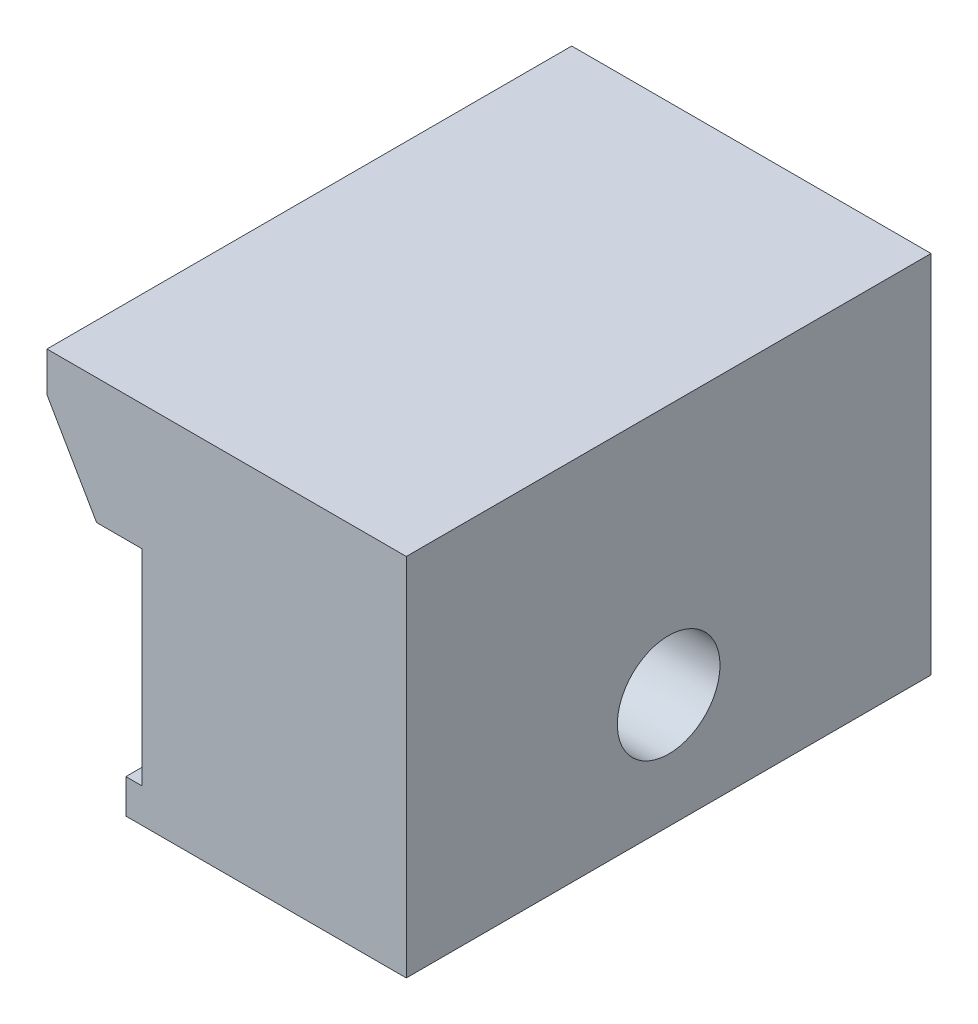
ISO-10303-21;
HEADER;
FILE_DESCRIPTION(('STEP AP214'),'2;1');
FILE_NAME('part.step','',(''),(''),'','','');
FILE_SCHEMA(('AUTOMOTIVE_DESIGN { 1 0 10303 214 1 1 1 1 }'));
ENDSEC;
DATA;
#1=APPLICATION_CONTEXT('core data for automotive mechanical design processes');
#2=APPLICATION_PROTOCOL_DEFINITION('international standard','automotive_design',2000,#1);
#3=PRODUCT_CONTEXT('',#1,'mechanical');
#4=PRODUCT('Part','Part','',(#3));
#5=PRODUCT_RELATED_PRODUCT_CATEGORY('part','',(#4));
#6=PRODUCT_DEFINITION_FORMATION('','',#4);
#7=PRODUCT_DEFINITION_CONTEXT('part definition',#1,'design');
#8=PRODUCT_DEFINITION('design','',#6,#7);
#9=PRODUCT_DEFINITION_SHAPE('','',#8);
#10=(LENGTH_UNIT() NAMED_UNIT(*) SI_UNIT(.MILLI.,.METRE.));
#11=(NAMED_UNIT(*) PLANE_ANGLE_UNIT() SI_UNIT($,.RADIAN.));
#12=(NAMED_UNIT(*) SI_UNIT($,.STERADIAN.) SOLID_ANGLE_UNIT());
#13=UNCERTAINTY_MEASURE_WITH_UNIT(LENGTH_MEASURE(1.E-05),#10,'distance_accuracy_value','');
#14=(GEOMETRIC_REPRESENTATION_CONTEXT(3) GLOBAL_UNCERTAINTY_ASSIGNED_CONTEXT((#13)) GLOBAL_UNIT_ASSIGNED_CONTEXT((#10,
#11,#12)) REPRESENTATION_CONTEXT('',''));
#15=CARTESIAN_POINT('',(0.,0.,0.));
#16=DIRECTION('',(0.,0.,1.));
#17=DIRECTION('',(1.,0.,0.));
#18=AXIS2_PLACEMENT_3D('',#15,#16,#17);
#19=CARTESIAN_POINT('',(0.,16.,23.));
#20=DIRECTION('',(-1.,0.,0.));
#21=DIRECTION('',(0.,-1.,0.));
#22=AXIS2_PLACEMENT_3D('',#19,#20,#21);
#23=PLANE('',#22);
#24=CARTESIAN_POINT('',(0.,5.,11.5));
#25=DIRECTION('',(1.,0.,0.));
#26=DIRECTION('',(0.,0.,-1.));
#27=AXIS2_PLACEMENT_3D('',#24,#25,#26);
#28=CIRCLE('',#27,2.24999999999999);
#29=CARTESIAN_POINT('',(0.,5.,9.25000000000001));
#30=VERTEX_POINT('',#29);
#31=EDGE_CURVE('E153',#30,#30,#28,.T.);
#32=ORIENTED_EDGE('',*,*,#31,.F.);
#33=EDGE_LOOP('',(#32));
#34=FACE_BOUND('',#33,.T.);
#35=DIRECTION('',(0.,1.,0.));
#36=VECTOR('',#35,1.);
#37=CARTESIAN_POINT('',(0.,16.,0.));
#38=LINE('',#37,#36);
#39=CARTESIAN_POINT('',(0.,0.,0.));
#40=VERTEX_POINT('',#39);
#41=CARTESIAN_POINT('',(0.,16.,0.));
#42=VERTEX_POINT('',#41);
#43=EDGE_CURVE('E124',#40,#42,#38,.T.);
#44=ORIENTED_EDGE('',*,*,#43,.T.);
#45=DIRECTION('',(0.,0.,-1.));
#46=VECTOR('',#45,1.);
#47=CARTESIAN_POINT('',(0.,16.,23.));
#48=LINE('',#47,#46);
#49=CARTESIAN_POINT('',(0.,16.,23.));
#50=VERTEX_POINT('',#49);
#51=EDGE_CURVE('E107',#50,#42,#48,.T.);
#52=ORIENTED_EDGE('',*,*,#51,.F.);
#53=DIRECTION('',(0.,1.,0.));
#54=VECTOR('',#53,1.);
#55=CARTESIAN_POINT('',(0.,16.,23.));
#56=LINE('',#55,#54);
#57=CARTESIAN_POINT('',(0.,0.,23.));
#58=VERTEX_POINT('',#57);
#59=EDGE_CURVE('E112',#58,#50,#56,.T.);
#60=ORIENTED_EDGE('',*,*,#59,.F.);
#61=DIRECTION('',(0.,0.,-1.));
#62=VECTOR('',#61,1.);
#63=CARTESIAN_POINT('',(0.,0.,23.));
#64=LINE('',#63,#62);
#65=EDGE_CURVE('E167',#58,#40,#64,.T.);
#66=ORIENTED_EDGE('',*,*,#65,.T.);
#67=EDGE_LOOP('',(#44,#52,#60,#66));
#68=FACE_BOUND('',#67,.T.);
#69=ADVANCED_FACE('F36',(#34,#68),#23,.F.);
#70=CARTESIAN_POINT('',(-16.75,16.,23.));
#71=DIRECTION('',(0.,-1.,0.));
#72=DIRECTION('',(1.,0.,0.));
#73=AXIS2_PLACEMENT_3D('',#70,#71,#72);
#74=PLANE('',#73);
#75=DIRECTION('',(-1.,0.,0.));
#76=VECTOR('',#75,1.);
#77=CARTESIAN_POINT('',(-16.75,16.,0.));
#78=LINE('',#77,#76);
#79=CARTESIAN_POINT('',(-15.75,16.,0.));
#80=VERTEX_POINT('',#79);
#81=EDGE_CURVE('E169',#42,#80,#78,.T.);
#82=ORIENTED_EDGE('',*,*,#81,.T.);
#83=DIRECTION('',(0.,0.,1.));
#84=VECTOR('',#83,1.);
#85=CARTESIAN_POINT('',(-15.75,16.,23.));
#86=LINE('',#85,#84);
#87=CARTESIAN_POINT('',(-15.75,16.,23.));
#88=VERTEX_POINT('',#87);
#89=EDGE_CURVE('E44',#80,#88,#86,.T.);
#90=ORIENTED_EDGE('',*,*,#89,.T.);
#91=DIRECTION('',(-1.,0.,0.));
#92=VECTOR('',#91,1.);
#93=CARTESIAN_POINT('',(-16.75,16.,23.));
#94=LINE('',#93,#92);
#95=EDGE_CURVE('E103',#50,#88,#94,.T.);
#96=ORIENTED_EDGE('',*,*,#95,.F.);
#97=ORIENTED_EDGE('',*,*,#51,.T.);
#98=EDGE_LOOP('',(#82,#90,#96,#97));
#99=FACE_BOUND('',#98,.T.);
#100=ADVANCED_FACE('F105',(#99),#74,.F.);
#101=CARTESIAN_POINT('',(-13.574573519457,10.5,23.));
#102=DIRECTION('',(0.866025403784436,0.500000000000005,0.));
#103=DIRECTION('',(-0.500000000000005,0.866025403784436,0.));
#104=AXIS2_PLACEMENT_3D('',#101,#102,#103);
#105=PLANE('',#104);
#106=DIRECTION('',(0.500000000000005,-0.866025403784436,0.));
#107=VECTOR('',#106,1.);
#108=CARTESIAN_POINT('',(-13.574573519457,10.5,23.));
#109=LINE('',#108,#107);
#110=CARTESIAN_POINT('',(-15.75,14.2679491924312,23.));
#111=VERTEX_POINT('',#110);
#112=CARTESIAN_POINT('',(-13.574573519457,10.5,23.));
#113=VERTEX_POINT('',#112);
#114=EDGE_CURVE('E111',#111,#113,#109,.T.);
#115=ORIENTED_EDGE('',*,*,#114,.F.);
#116=DIRECTION('',(0.,0.,-1.));
#117=VECTOR('',#116,1.);
#118=CARTESIAN_POINT('',(-15.75,14.2679491924312,23.));
#119=LINE('',#118,#117);
#120=CARTESIAN_POINT('',(-15.75,14.2679491924311,0.));
#121=VERTEX_POINT('',#120);
#122=EDGE_CURVE('E125',#111,#121,#119,.T.);
#123=ORIENTED_EDGE('',*,*,#122,.T.);
#124=DIRECTION('',(0.500000000000005,-0.866025403784436,0.));
#125=VECTOR('',#124,1.);
#126=CARTESIAN_POINT('',(-13.574573519457,10.5,0.));
#127=LINE('',#126,#125);
#128=CARTESIAN_POINT('',(-13.574573519457,10.5,0.));
#129=VERTEX_POINT('',#128);
#130=EDGE_CURVE('E171',#121,#129,#127,.T.);
#131=ORIENTED_EDGE('',*,*,#130,.T.);
#132=DIRECTION('',(0.,0.,-1.));
#133=VECTOR('',#132,1.);
#134=CARTESIAN_POINT('',(-13.574573519457,10.5,23.));
#135=LINE('',#134,#133);
#136=EDGE_CURVE('E126',#113,#129,#135,.T.);
#137=ORIENTED_EDGE('',*,*,#136,.F.);
#138=EDGE_LOOP('',(#115,#123,#131,#137));
#139=FACE_BOUND('',#138,.T.);
#140=ADVANCED_FACE('F217',(#139),#105,.F.);
#141=CARTESIAN_POINT('',(-13.574573519457,10.5,23.));
#142=DIRECTION('',(0.,1.,0.));
#143=DIRECTION('',(0.,0.,1.));
#144=AXIS2_PLACEMENT_3D('',#141,#142,#143);
#145=PLANE('',#144);
#146=DIRECTION('',(1.,0.,0.));
#147=VECTOR('',#146,1.);
#148=CARTESIAN_POINT('',(-13.574573519457,10.5,0.));
#149=LINE('',#148,#147);
#150=CARTESIAN_POINT('',(-11.574573519457,10.5,0.));
#151=VERTEX_POINT('',#150);
#152=EDGE_CURVE('E173',#129,#151,#149,.T.);
#153=ORIENTED_EDGE('',*,*,#152,.T.);
#154=DIRECTION('',(0.,0.,-1.));
#155=VECTOR('',#154,1.);
#156=CARTESIAN_POINT('',(-11.574573519457,10.5,23.));
#157=LINE('',#156,#155);
#158=CARTESIAN_POINT('',(-11.574573519457,10.5,23.));
#159=VERTEX_POINT('',#158);
#160=EDGE_CURVE('E131',#159,#151,#157,.T.);
#161=ORIENTED_EDGE('',*,*,#160,.F.);
#162=DIRECTION('',(1.,0.,0.));
#163=VECTOR('',#162,1.);
#164=CARTESIAN_POINT('',(-13.574573519457,10.5,23.));
#165=LINE('',#164,#163);
#166=EDGE_CURVE('E158',#113,#159,#165,.T.);
#167=ORIENTED_EDGE('',*,*,#166,.F.);
#168=ORIENTED_EDGE('',*,*,#136,.T.);
#169=EDGE_LOOP('',(#153,#161,#167,#168));
#170=FACE_BOUND('',#169,.T.);
#171=ADVANCED_FACE('F215',(#170),#145,.F.);
#172=CARTESIAN_POINT('',(-11.574573519457,10.5,23.));
#173=DIRECTION('',(1.,0.,0.));
#174=DIRECTION('',(0.,1.,0.));
#175=AXIS2_PLACEMENT_3D('',#172,#173,#174);
#176=PLANE('',#175);
#177=CARTESIAN_POINT('',(-11.574573519457,5.,11.5));
#178=DIRECTION('',(1.,0.,0.));
#179=DIRECTION('',(0.,1.,0.));
#180=AXIS2_PLACEMENT_3D('',#177,#178,#179);
#181=CIRCLE('',#180,2.24999999999999);
#182=CARTESIAN_POINT('',(-11.574573519457,7.24999999999999,11.5));
#183=VERTEX_POINT('',#182);
#184=EDGE_CURVE('E148',#183,#183,#181,.T.);
#185=ORIENTED_EDGE('',*,*,#184,.T.);
#186=EDGE_LOOP('',(#185));
#187=FACE_BOUND('',#186,.T.);
#188=CARTESIAN_POINT('',(-11.574573519457,5.,4.));
#189=DIRECTION('',(1.,0.,0.));
#190=DIRECTION('',(0.,1.,0.));
#191=AXIS2_PLACEMENT_3D('',#188,#189,#190);
#192=CIRCLE('',#191,2.5);
#193=CARTESIAN_POINT('',(-11.574573519457,7.50000000000001,4.));
#194=VERTEX_POINT('',#193);
#195=EDGE_CURVE('E139',#194,#194,#192,.T.);
#196=ORIENTED_EDGE('',*,*,#195,.T.);
#197=EDGE_LOOP('',(#196));
#198=FACE_BOUND('',#197,.T.);
#199=CARTESIAN_POINT('',(-11.574573519457,5.,19.));
#200=DIRECTION('',(1.,0.,0.));
#201=DIRECTION('',(0.,1.,0.));
#202=AXIS2_PLACEMENT_3D('',#199,#200,#201);
#203=CIRCLE('',#202,2.5);
#204=CARTESIAN_POINT('',(-11.574573519457,7.5,19.));
#205=VERTEX_POINT('',#204);
#206=EDGE_CURVE('E135',#205,#205,#203,.T.);
#207=ORIENTED_EDGE('',*,*,#206,.T.);
#208=EDGE_LOOP('',(#207));
#209=FACE_BOUND('',#208,.T.);
#210=DIRECTION('',(0.,-1.,0.));
#211=VECTOR('',#210,1.);
#212=CARTESIAN_POINT('',(-11.574573519457,10.5,0.));
#213=LINE('',#212,#211);
#214=CARTESIAN_POINT('',(-11.574573519457,1.5,0.));
#215=VERTEX_POINT('',#214);
#216=EDGE_CURVE('E175',#151,#215,#213,.T.);
#217=ORIENTED_EDGE('',*,*,#216,.T.);
#218=DIRECTION('',(0.,0.,-1.));
#219=VECTOR('',#218,1.);
#220=CARTESIAN_POINT('',(-11.574573519457,1.5,23.));
#221=LINE('',#220,#219);
#222=CARTESIAN_POINT('',(-11.574573519457,1.5,23.));
#223=VERTEX_POINT('',#222);
#224=EDGE_CURVE('E189',#223,#215,#221,.T.);
#225=ORIENTED_EDGE('',*,*,#224,.F.);
#226=DIRECTION('',(0.,-1.,0.));
#227=VECTOR('',#226,1.);
#228=CARTESIAN_POINT('',(-11.574573519457,10.5,23.));
#229=LINE('',#228,#227);
#230=EDGE_CURVE('E160',#159,#223,#229,.T.);
#231=ORIENTED_EDGE('',*,*,#230,.F.);
#232=ORIENTED_EDGE('',*,*,#160,.T.);
#233=EDGE_LOOP('',(#217,#225,#231,#232));
#234=FACE_BOUND('',#233,.T.);
#235=ADVANCED_FACE('F196',(#187,#198,#209,#234),#176,.F.);
#236=CARTESIAN_POINT('',(-12.29,1.5,23.));
#237=DIRECTION('',(0.,-1.,0.));
#238=DIRECTION('',(1.,0.,0.));
#239=AXIS2_PLACEMENT_3D('',#236,#237,#238);
#240=PLANE('',#239);
#241=DIRECTION('',(-1.,0.,0.));
#242=VECTOR('',#241,1.);
#243=CARTESIAN_POINT('',(-12.29,1.5,0.));
#244=LINE('',#243,#242);
#245=CARTESIAN_POINT('',(-12.29,1.5,0.));
#246=VERTEX_POINT('',#245);
#247=EDGE_CURVE('E177',#215,#246,#244,.T.);
#248=ORIENTED_EDGE('',*,*,#247,.T.);
#249=DIRECTION('',(0.,0.,-1.));
#250=VECTOR('',#249,1.);
#251=CARTESIAN_POINT('',(-12.29,1.5,23.));
#252=LINE('',#251,#250);
#253=CARTESIAN_POINT('',(-12.29,1.5,23.));
#254=VERTEX_POINT('',#253);
#255=EDGE_CURVE('E186',#254,#246,#252,.T.);
#256=ORIENTED_EDGE('',*,*,#255,.F.);
#257=DIRECTION('',(-1.,0.,0.));
#258=VECTOR('',#257,1.);
#259=CARTESIAN_POINT('',(-12.29,1.5,23.));
#260=LINE('',#259,#258);
#261=EDGE_CURVE('E162',#223,#254,#260,.T.);
#262=ORIENTED_EDGE('',*,*,#261,.F.);
#263=ORIENTED_EDGE('',*,*,#224,.T.);
#264=EDGE_LOOP('',(#248,#256,#262,#263));
#265=FACE_BOUND('',#264,.T.);
#266=ADVANCED_FACE('F207',(#265),#240,.F.);
#267=CARTESIAN_POINT('',(-12.29,0.,23.));
#268=DIRECTION('',(1.,0.,0.));
#269=DIRECTION('',(0.,1.,0.));
#270=AXIS2_PLACEMENT_3D('',#267,#268,#269);
#271=PLANE('',#270);
#272=DIRECTION('',(0.,-1.,0.));
#273=VECTOR('',#272,1.);
#274=CARTESIAN_POINT('',(-12.29,0.,0.));
#275=LINE('',#274,#273);
#276=CARTESIAN_POINT('',(-12.29,0.,0.));
#277=VERTEX_POINT('',#276);
#278=EDGE_CURVE('E179',#246,#277,#275,.T.);
#279=ORIENTED_EDGE('',*,*,#278,.T.);
#280=DIRECTION('',(0.,0.,-1.));
#281=VECTOR('',#280,1.);
#282=CARTESIAN_POINT('',(-12.29,0.,23.));
#283=LINE('',#282,#281);
#284=CARTESIAN_POINT('',(-12.29,0.,23.));
#285=VERTEX_POINT('',#284);
#286=EDGE_CURVE('E183',#285,#277,#283,.T.);
#287=ORIENTED_EDGE('',*,*,#286,.F.);
#288=DIRECTION('',(0.,-1.,0.));
#289=VECTOR('',#288,1.);
#290=CARTESIAN_POINT('',(-12.29,0.,23.));
#291=LINE('',#290,#289);
#292=EDGE_CURVE('E164',#254,#285,#291,.T.);
#293=ORIENTED_EDGE('',*,*,#292,.F.);
#294=ORIENTED_EDGE('',*,*,#255,.T.);
#295=EDGE_LOOP('',(#279,#287,#293,#294));
#296=FACE_BOUND('',#295,.T.);
#297=ADVANCED_FACE('F211',(#296),#271,.F.);
#298=CARTESIAN_POINT('',(0.,0.,23.));
#299=DIRECTION('',(0.,1.,0.));
#300=DIRECTION('',(-1.,0.,0.));
#301=AXIS2_PLACEMENT_3D('',#298,#299,#300);
#302=PLANE('',#301);
#303=DIRECTION('',(1.,0.,0.));
#304=VECTOR('',#303,1.);
#305=CARTESIAN_POINT('',(0.,0.,0.));
#306=LINE('',#305,#304);
#307=EDGE_CURVE('E121',#277,#40,#306,.T.);
#308=ORIENTED_EDGE('',*,*,#307,.T.);
#309=ORIENTED_EDGE('',*,*,#65,.F.);
#310=DIRECTION('',(1.,0.,0.));
#311=VECTOR('',#310,1.);
#312=CARTESIAN_POINT('',(0.,0.,23.));
#313=LINE('',#312,#311);
#314=EDGE_CURVE('E117',#285,#58,#313,.T.);
#315=ORIENTED_EDGE('',*,*,#314,.F.);
#316=ORIENTED_EDGE('',*,*,#286,.T.);
#317=EDGE_LOOP('',(#308,#309,#315,#316));
#318=FACE_BOUND('',#317,.T.);
#319=ADVANCED_FACE('F248',(#318),#302,.F.);
#320=CARTESIAN_POINT('',(0.,0.,23.));
#321=DIRECTION('',(0.,0.,-1.));
#322=DIRECTION('',(-1.,0.,0.));
#323=AXIS2_PLACEMENT_3D('',#320,#321,#322);
#324=PLANE('',#323);
#325=ORIENTED_EDGE('',*,*,#95,.T.);
#326=DIRECTION('',(0.,1.,0.));
#327=VECTOR('',#326,1.);
#328=CARTESIAN_POINT('',(-15.75,14.2679491924312,23.));
#329=LINE('',#328,#327);
#330=EDGE_CURVE('E11',#88,#111,#329,.F.);
#331=ORIENTED_EDGE('',*,*,#330,.T.);
#332=ORIENTED_EDGE('',*,*,#114,.T.);
#333=ORIENTED_EDGE('',*,*,#166,.T.);
#334=ORIENTED_EDGE('',*,*,#230,.T.);
#335=ORIENTED_EDGE('',*,*,#261,.T.);
#336=ORIENTED_EDGE('',*,*,#292,.T.);
#337=ORIENTED_EDGE('',*,*,#314,.T.);
#338=ORIENTED_EDGE('',*,*,#59,.T.);
#339=EDGE_LOOP('',(#325,#331,#332,#333,#334,#335,#336,#337,#338));
#340=FACE_BOUND('',#339,.T.);
#341=ADVANCED_FACE('F115',(#340),#324,.F.);
#342=CARTESIAN_POINT('',(0.,0.,0.));
#343=DIRECTION('',(0.,0.,-1.));
#344=DIRECTION('',(-1.,0.,0.));
#345=AXIS2_PLACEMENT_3D('',#342,#343,#344);
#346=PLANE('',#345);
#347=ORIENTED_EDGE('',*,*,#130,.F.);
#348=DIRECTION('',(0.,-1.,0.));
#349=VECTOR('',#348,1.);
#350=CARTESIAN_POINT('',(-15.75,0.,0.));
#351=LINE('',#350,#349);
#352=EDGE_CURVE('E58',#121,#80,#351,.F.);
#353=ORIENTED_EDGE('',*,*,#352,.T.);
#354=ORIENTED_EDGE('',*,*,#81,.F.);
#355=ORIENTED_EDGE('',*,*,#43,.F.);
#356=ORIENTED_EDGE('',*,*,#307,.F.);
#357=ORIENTED_EDGE('',*,*,#278,.F.);
#358=ORIENTED_EDGE('',*,*,#247,.F.);
#359=ORIENTED_EDGE('',*,*,#216,.F.);
#360=ORIENTED_EDGE('',*,*,#152,.F.);
#361=EDGE_LOOP('',(#347,#353,#354,#355,#356,#357,#358,#359,#360));
#362=FACE_BOUND('',#361,.T.);
#363=ADVANCED_FACE('F202',(#362),#346,.T.);
#364=CARTESIAN_POINT('',(-16.75,5.,19.));
#365=DIRECTION('',(1.,0.,0.));
#366=DIRECTION('',(0.,0.,-1.));
#367=AXIS2_PLACEMENT_3D('',#364,#365,#366);
#368=CYLINDRICAL_SURFACE('',#367,2.5);
#369=CARTESIAN_POINT('',(-7.57457351945701,5.,19.));
#370=DIRECTION('',(1.,0.,0.));
#371=DIRECTION('',(0.,0.,-1.));
#372=AXIS2_PLACEMENT_3D('',#369,#370,#371);
#373=CIRCLE('',#372,2.5);
#374=CARTESIAN_POINT('',(-7.57457351945701,5.,16.5));
#375=VERTEX_POINT('',#374);
#376=EDGE_CURVE('E138',#375,#375,#373,.T.);
#377=ORIENTED_EDGE('',*,*,#376,.T.);
#378=EDGE_LOOP('',(#377));
#379=FACE_BOUND('',#378,.T.);
#380=ORIENTED_EDGE('',*,*,#206,.F.);
#381=EDGE_LOOP('',(#380));
#382=FACE_BOUND('',#381,.T.);
#383=ADVANCED_FACE('F254',(#379,#382),#368,.F.);
#384=CARTESIAN_POINT('',(-7.57457351945701,5.,19.));
#385=DIRECTION('',(1.,0.,0.));
#386=DIRECTION('',(0.,0.,-1.));
#387=AXIS2_PLACEMENT_3D('',#384,#385,#386);
#388=PLANE('',#387);
#389=ORIENTED_EDGE('',*,*,#376,.F.);
#390=EDGE_LOOP('',(#389));
#391=FACE_BOUND('',#390,.T.);
#392=ADVANCED_FACE('F259',(#391),#388,.F.);
#393=CARTESIAN_POINT('',(-16.75,5.,4.));
#394=DIRECTION('',(1.,0.,0.));
#395=DIRECTION('',(0.,0.,-1.));
#396=AXIS2_PLACEMENT_3D('',#393,#394,#395);
#397=CYLINDRICAL_SURFACE('',#396,2.5);
#398=CARTESIAN_POINT('',(-7.57457351945701,5.,4.));
#399=DIRECTION('',(1.,0.,0.));
#400=DIRECTION('',(0.,0.,1.));
#401=AXIS2_PLACEMENT_3D('',#398,#399,#400);
#402=CIRCLE('',#401,2.5);
#403=CARTESIAN_POINT('',(-7.57457351945701,5.,6.5));
#404=VERTEX_POINT('',#403);
#405=EDGE_CURVE('E141',#404,#404,#402,.T.);
#406=ORIENTED_EDGE('',*,*,#405,.T.);
#407=EDGE_LOOP('',(#406));
#408=FACE_BOUND('',#407,.T.);
#409=ORIENTED_EDGE('',*,*,#195,.F.);
#410=EDGE_LOOP('',(#409));
#411=FACE_BOUND('',#410,.T.);
#412=ADVANCED_FACE('F263',(#408,#411),#397,.F.);
#413=CARTESIAN_POINT('',(-7.57457351945701,5.,4.));
#414=DIRECTION('',(-1.,0.,0.));
#415=DIRECTION('',(0.,0.,1.));
#416=AXIS2_PLACEMENT_3D('',#413,#414,#415);
#417=PLANE('',#416);
#418=ORIENTED_EDGE('',*,*,#405,.F.);
#419=EDGE_LOOP('',(#418));
#420=FACE_BOUND('',#419,.T.);
#421=ADVANCED_FACE('F225',(#420),#417,.T.);
#422=CARTESIAN_POINT('',(0.,5.,11.5));
#423=DIRECTION('',(1.,0.,0.));
#424=DIRECTION('',(0.,0.,-1.));
#425=AXIS2_PLACEMENT_3D('',#422,#423,#424);
#426=CYLINDRICAL_SURFACE('',#425,2.24999999999999);
#427=ORIENTED_EDGE('',*,*,#31,.T.);
#428=EDGE_LOOP('',(#427));
#429=FACE_BOUND('',#428,.T.);
#430=ORIENTED_EDGE('',*,*,#184,.F.);
#431=EDGE_LOOP('',(#430));
#432=FACE_BOUND('',#431,.T.);
#433=ADVANCED_FACE('F221',(#429,#432),#426,.F.);
#434=CARTESIAN_POINT('',(-15.75,14.2679491924312,23.));
#435=DIRECTION('',(1.,0.,0.));
#436=DIRECTION('',(0.,0.,-1.));
#437=AXIS2_PLACEMENT_3D('',#434,#435,#436);
#438=PLANE('',#437);
#439=ORIENTED_EDGE('',*,*,#330,.F.);
#440=ORIENTED_EDGE('',*,*,#89,.F.);
#441=ORIENTED_EDGE('',*,*,#352,.F.);
#442=ORIENTED_EDGE('',*,*,#122,.F.);
#443=EDGE_LOOP('',(#439,#440,#441,#442));
#444=FACE_BOUND('',#443,.T.);
#445=ADVANCED_FACE('F38',(#444),#438,.F.);
#446=CLOSED_SHELL('',(#69,#100,#140,#171,#235,#266,#297,#319,#341,#363,#383,#392,#412,#421,#433,#445));
#447=MANIFOLD_SOLID_BREP('B2',#446);
#448=ADVANCED_BREP_SHAPE_REPRESENTATION('',(#18,#447),#14);
#449=SHAPE_DEFINITION_REPRESENTATION(#9,#448);
ENDSEC;
END-ISO-10303-21;
